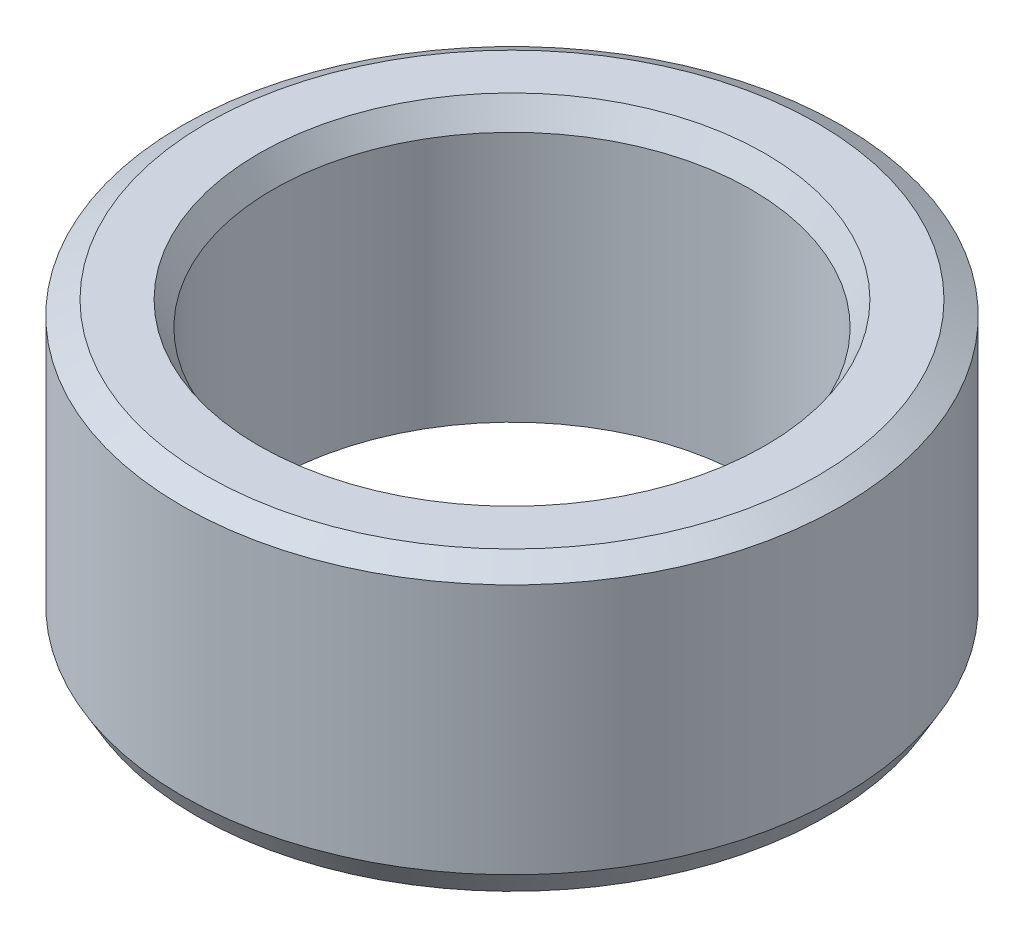
ISO-10303-21;
HEADER;
FILE_DESCRIPTION(('STEP AP214'),'2;1');
FILE_NAME('part.step','',(''),(''),'','','');
FILE_SCHEMA(('AUTOMOTIVE_DESIGN { 1 0 10303 214 1 1 1 1 }'));
ENDSEC;
DATA;
#1=APPLICATION_CONTEXT('core data for automotive mechanical design processes');
#2=APPLICATION_PROTOCOL_DEFINITION('international standard','automotive_design',2000,#1);
#3=PRODUCT_CONTEXT('',#1,'mechanical');
#4=PRODUCT('Part','Part','',(#3));
#5=PRODUCT_RELATED_PRODUCT_CATEGORY('part','',(#4));
#6=PRODUCT_DEFINITION_FORMATION('','',#4);
#7=PRODUCT_DEFINITION_CONTEXT('part definition',#1,'design');
#8=PRODUCT_DEFINITION('design','',#6,#7);
#9=PRODUCT_DEFINITION_SHAPE('','',#8);
#10=(LENGTH_UNIT() NAMED_UNIT(*) SI_UNIT(.MILLI.,.METRE.));
#11=(NAMED_UNIT(*) PLANE_ANGLE_UNIT() SI_UNIT($,.RADIAN.));
#12=(NAMED_UNIT(*) SI_UNIT($,.STERADIAN.) SOLID_ANGLE_UNIT());
#13=UNCERTAINTY_MEASURE_WITH_UNIT(LENGTH_MEASURE(1.E-05),#10,'distance_accuracy_value','');
#14=(GEOMETRIC_REPRESENTATION_CONTEXT(3) GLOBAL_UNCERTAINTY_ASSIGNED_CONTEXT((#13)) GLOBAL_UNIT_ASSIGNED_CONTEXT((#10,
#11,#12)) REPRESENTATION_CONTEXT('',''));
#15=CARTESIAN_POINT('',(0.,0.,0.));
#16=DIRECTION('',(0.,0.,1.));
#17=DIRECTION('',(1.,0.,0.));
#18=AXIS2_PLACEMENT_3D('',#15,#16,#17);
#19=CARTESIAN_POINT('',(0.,10.9655938453423,0.));
#20=DIRECTION('',(0.,-1.,0.));
#21=DIRECTION('',(0.,0.,-1.));
#22=AXIS2_PLACEMENT_3D('',#19,#20,#21);
#23=CYLINDRICAL_SURFACE('',#22,12.5);
#24=CARTESIAN_POINT('',(0.,0.917911089490356,0.));
#25=DIRECTION('',(0.,1.,0.));
#26=DIRECTION('',(0.,0.,1.));
#27=AXIS2_PLACEMENT_3D('',#24,#25,#26);
#28=CIRCLE('',#27,12.5);
#29=CARTESIAN_POINT('',(0.,0.917911089490356,-12.5));
#30=VERTEX_POINT('',#29);
#31=EDGE_CURVE('E10',#30,#30,#28,.T.);
#32=CARTESIAN_POINT('',(0.,10.435637630733,0.));
#33=DIRECTION('',(0.,1.,0.));
#34=DIRECTION('',(0.,0.,1.));
#35=AXIS2_PLACEMENT_3D('',#32,#33,#34);
#36=CIRCLE('',#35,12.5);
#37=CARTESIAN_POINT('',(0.,10.435637630733,-12.5));
#38=VERTEX_POINT('',#37);
#39=EDGE_CURVE('E50',#38,#38,#36,.F.);
#40=CARTESIAN_POINT('',(0.,0.917911089490356,-12.5));
#41=CARTESIAN_POINT('',(0.,1.01705407429497,-12.5));
#42=CARTESIAN_POINT('',(0.,1.11619705909958,-12.5));
#43=CARTESIAN_POINT('',(0.,1.3144830287088,-12.5));
#44=CARTESIAN_POINT('',(0.,1.41362601351341,-12.5));
#45=CARTESIAN_POINT('',(0.,1.61191198312263,-12.5));
#46=CARTESIAN_POINT('',(0.,1.71105496792724,-12.5));
#47=CARTESIAN_POINT('',(0.,1.90934093753646,-12.5));
#48=CARTESIAN_POINT('',(0.,2.00848392234107,-12.5));
#49=CARTESIAN_POINT('',(0.,2.20676989195029,-12.5));
#50=CARTESIAN_POINT('',(0.,2.3059128767549,-12.5));
#51=CARTESIAN_POINT('',(0.,2.50419884636413,-12.5));
#52=CARTESIAN_POINT('',(0.,2.60334183116874,-12.5));
#53=CARTESIAN_POINT('',(0.,2.80162780077796,-12.5));
#54=CARTESIAN_POINT('',(0.,2.90077078558257,-12.5));
#55=CARTESIAN_POINT('',(0.,3.09905675519179,-12.5));
#56=CARTESIAN_POINT('',(0.,3.1981997399964,-12.5));
#57=CARTESIAN_POINT('',(0.,3.39648570960562,-12.5));
#58=CARTESIAN_POINT('',(0.,3.49562869441023,-12.5));
#59=CARTESIAN_POINT('',(0.,3.69391466401945,-12.5));
#60=CARTESIAN_POINT('',(0.,3.79305764882406,-12.5));
#61=CARTESIAN_POINT('',(0.,3.99134361843328,-12.5));
#62=CARTESIAN_POINT('',(0.,4.09048660323789,-12.5));
#63=CARTESIAN_POINT('',(0.,4.28877257284712,-12.5));
#64=CARTESIAN_POINT('',(0.,4.38791555765173,-12.5));
#65=CARTESIAN_POINT('',(0.,4.58620152726095,-12.5));
#66=CARTESIAN_POINT('',(0.,4.68534451206556,-12.5));
#67=CARTESIAN_POINT('',(0.,4.88363048167478,-12.5));
#68=CARTESIAN_POINT('',(0.,4.98277346647939,-12.5));
#69=CARTESIAN_POINT('',(0.,5.18105943608861,-12.5));
#70=CARTESIAN_POINT('',(0.,5.28020242089322,-12.5));
#71=CARTESIAN_POINT('',(0.,5.47848839050244,-12.5));
#72=CARTESIAN_POINT('',(0.,5.57763137530705,-12.5));
#73=CARTESIAN_POINT('',(0.,5.77591734491627,-12.5));
#74=CARTESIAN_POINT('',(0.,5.87506032972089,-12.5));
#75=CARTESIAN_POINT('',(0.,6.07334629933011,-12.5));
#76=CARTESIAN_POINT('',(0.,6.17248928413472,-12.5));
#77=CARTESIAN_POINT('',(0.,6.37077525374394,-12.5));
#78=CARTESIAN_POINT('',(0.,6.46991823854855,-12.5));
#79=CARTESIAN_POINT('',(0.,6.66820420815777,-12.5));
#80=CARTESIAN_POINT('',(0.,6.76734719296238,-12.5));
#81=CARTESIAN_POINT('',(0.,6.9656331625716,-12.5));
#82=CARTESIAN_POINT('',(0.,7.06477614737621,-12.5));
#83=CARTESIAN_POINT('',(0.,7.26306211698543,-12.5));
#84=CARTESIAN_POINT('',(0.,7.36220510179004,-12.5));
#85=CARTESIAN_POINT('',(0.,7.56049107139927,-12.5));
#86=CARTESIAN_POINT('',(0.,7.65963405620388,-12.5));
#87=CARTESIAN_POINT('',(0.,7.8579200258131,-12.5));
#88=CARTESIAN_POINT('',(0.,7.95706301061771,-12.5));
#89=CARTESIAN_POINT('',(0.,8.15534898022693,-12.5));
#90=CARTESIAN_POINT('',(0.,8.25449196503154,-12.5));
#91=CARTESIAN_POINT('',(0.,8.45277793464076,-12.5));
#92=CARTESIAN_POINT('',(0.,8.55192091944537,-12.5));
#93=CARTESIAN_POINT('',(0.,8.75020688905459,-12.5));
#94=CARTESIAN_POINT('',(0.,8.8493498738592,-12.5));
#95=CARTESIAN_POINT('',(0.,9.04763584346842,-12.5));
#96=CARTESIAN_POINT('',(0.,9.14677882827304,-12.5));
#97=CARTESIAN_POINT('',(0.,9.34506479788226,-12.5));
#98=CARTESIAN_POINT('',(0.,9.44420778268687,-12.5));
#99=CARTESIAN_POINT('',(0.,9.64249375229609,-12.5));
#100=CARTESIAN_POINT('',(0.,9.7416367371007,-12.5));
#101=CARTESIAN_POINT('',(0.,9.93992270670992,-12.5));
#102=CARTESIAN_POINT('',(0.,10.0390656915145,-12.5));
#103=CARTESIAN_POINT('',(0.,10.2373516611238,-12.5));
#104=CARTESIAN_POINT('',(0.,10.3364946459284,-12.5));
#105=CARTESIAN_POINT('',(0.,10.435637630733,-12.5));
#106=B_SPLINE_CURVE_WITH_KNOTS('',3,(#40,#41,#42,#43,#44,#45,#46,#47,#48,#49,#50,#51,#52,#53,
#54,#55,#56,#57,#58,#59,#60,#61,#62,#63,#64,#65,#66,#67,#68,#69,#70,#71,#72,#73,#74,#75,#76,#77,
#78,#79,#80,#81,#82,#83,#84,#85,#86,#87,#88,#89,#90,#91,#92,#93,#94,#95,#96,#97,#98,#99,#100,
#101,#102,#103,#104,#105),.UNSPECIFIED.,.F.,.F.,(4,2,2,2,2,2,2,2,2,2,2,2,2,2,2,2,2,2,2,2,2,2,2,
2,2,2,2,2,2,2,2,2,4),(0.,0.297428954413832,0.594857908827663,0.892286863241495,1.18971581765533,
1.48714477206916,1.78457372648299,2.08200268089682,2.37943163531065,2.67686058972449,
2.97428954413832,3.27171849855215,3.56914745296598,3.86657640737981,4.16400536179364,
4.46143431620748,4.75886327062131,5.05629222503514,5.35372117944897,5.6511501338628,
5.94857908827664,6.24600804269047,6.5434369971043,6.84086595151813,7.13829490593196,
7.43572386034579,7.73315281475962,8.03058176917346,8.32801072358729,8.62543967800112,
8.92286863241495,9.22029758682878,9.51772654124261),.UNSPECIFIED.);
#107=EDGE_CURVE('BSEAM39',#30,#38,#106,.T.);
#108=ORIENTED_EDGE('',*,*,#31,.T.);
#109=ORIENTED_EDGE('',*,*,#39,.T.);
#110=ORIENTED_EDGE('',*,*,#107,.T.);
#111=ORIENTED_EDGE('',*,*,#107,.F.);
#112=EDGE_LOOP('',(#108,#110,#109,#111));
#113=FACE_BOUND('',#112,.T.);
#114=ADVANCED_FACE('F39',(#113),#23,.T.);
#115=CARTESIAN_POINT('',(0.,10.9655938453423,0.));
#116=DIRECTION('',(0.,1.,0.));
#117=DIRECTION('',(0.,0.,1.));
#118=AXIS2_PLACEMENT_3D('',#115,#116,#117);
#119=PLANE('',#118);
#120=CARTESIAN_POINT('',(0.,10.9655938453423,0.));
#121=DIRECTION('',(0.,1.,0.));
#122=DIRECTION('',(0.,0.,1.));
#123=AXIS2_PLACEMENT_3D('',#120,#121,#122);
#124=CIRCLE('',#123,9.59589626051556);
#125=CARTESIAN_POINT('',(0.,10.9655938453423,9.59589626051556));
#126=VERTEX_POINT('',#125);
#127=EDGE_CURVE('E58',#126,#126,#124,.F.);
#128=ORIENTED_EDGE('',*,*,#127,.T.);
#129=EDGE_LOOP('',(#128));
#130=FACE_BOUND('',#129,.T.);
#131=CARTESIAN_POINT('',(0.,10.9655938453423,0.));
#132=DIRECTION('',(0.,1.,0.));
#133=DIRECTION('',(0.,0.,1.));
#134=AXIS2_PLACEMENT_3D('',#131,#132,#133);
#135=CIRCLE('',#134,11.5820889105097);
#136=CARTESIAN_POINT('',(0.,10.9655938453423,11.5820889105097));
#137=VERTEX_POINT('',#136);
#138=EDGE_CURVE('E61',#137,#137,#135,.T.);
#139=ORIENTED_EDGE('',*,*,#138,.T.);
#140=EDGE_LOOP('',(#139));
#141=FACE_BOUND('',#140,.T.);
#142=ADVANCED_FACE('F88',(#130,#141),#119,.T.);
#143=CARTESIAN_POINT('',(0.,0.,0.));
#144=DIRECTION('',(0.,1.,0.));
#145=DIRECTION('',(0.,0.,1.));
#146=AXIS2_PLACEMENT_3D('',#143,#144,#145);
#147=PLANE('',#146);
#148=CARTESIAN_POINT('',(0.,0.,0.));
#149=DIRECTION('',(0.,1.,0.));
#150=DIRECTION('',(0.,0.,1.));
#151=AXIS2_PLACEMENT_3D('',#148,#149,#150);
#152=CIRCLE('',#151,9.98385113539646);
#153=CARTESIAN_POINT('',(0.,0.,9.98385113539646));
#154=VERTEX_POINT('',#153);
#155=EDGE_CURVE('E51',#154,#154,#152,.T.);
#156=ORIENTED_EDGE('',*,*,#155,.T.);
#157=EDGE_LOOP('',(#156));
#158=FACE_BOUND('',#157,.T.);
#159=CARTESIAN_POINT('',(0.,0.,0.));
#160=DIRECTION('',(0.,1.,0.));
#161=DIRECTION('',(0.,0.,1.));
#162=AXIS2_PLACEMENT_3D('',#159,#160,#161);
#163=CIRCLE('',#162,11.9700437853906);
#164=CARTESIAN_POINT('',(0.,0.,11.9700437853906));
#165=VERTEX_POINT('',#164);
#166=EDGE_CURVE('E54',#165,#165,#163,.F.);
#167=ORIENTED_EDGE('',*,*,#166,.T.);
#168=EDGE_LOOP('',(#167));
#169=FACE_BOUND('',#168,.T.);
#170=ADVANCED_FACE('F83',(#158,#169),#147,.F.);
#171=CARTESIAN_POINT('',(0.,10.9655938453423,0.));
#172=DIRECTION('',(0.,-1.,0.));
#173=DIRECTION('',(0.,0.,-1.));
#174=AXIS2_PLACEMENT_3D('',#171,#172,#173);
#175=CYLINDRICAL_SURFACE('',#174,9.06594004590615);
#176=CARTESIAN_POINT('',(0.,10.047682755852,0.));
#177=DIRECTION('',(0.,1.,0.));
#178=DIRECTION('',(0.,0.,1.));
#179=AXIS2_PLACEMENT_3D('',#176,#177,#178);
#180=CIRCLE('',#179,9.06594004590615);
#181=CARTESIAN_POINT('',(0.,10.047682755852,-9.06594004590615));
#182=VERTEX_POINT('',#181);
#183=EDGE_CURVE('E67',#182,#182,#180,.T.);
#184=CARTESIAN_POINT('',(0.,0.529956214609375,0.));
#185=DIRECTION('',(0.,1.,0.));
#186=DIRECTION('',(0.,0.,1.));
#187=AXIS2_PLACEMENT_3D('',#184,#185,#186);
#188=CIRCLE('',#187,9.06594004590615);
#189=CARTESIAN_POINT('',(0.,0.529956214609373,-9.06594004590615));
#190=VERTEX_POINT('',#189);
#191=EDGE_CURVE('E69',#190,#190,#188,.F.);
#192=CARTESIAN_POINT('',(0.,10.047682755852,-9.06594004590615));
#193=CARTESIAN_POINT('',(0.,9.94853977104735,-9.06594004590615));
#194=CARTESIAN_POINT('',(0.,9.84939678624274,-9.06594004590615));
#195=CARTESIAN_POINT('',(0.,9.65111081663352,-9.06594004590615));
#196=CARTESIAN_POINT('',(0.,9.55196783182891,-9.06594004590615));
#197=CARTESIAN_POINT('',(0.,9.35368186221969,-9.06594004590615));
#198=CARTESIAN_POINT('',(0.,9.25453887741508,-9.06594004590615));
#199=CARTESIAN_POINT('',(0.,9.05625290780586,-9.06594004590615));
#200=CARTESIAN_POINT('',(0.,8.95710992300125,-9.06594004590615));
#201=CARTESIAN_POINT('',(0.,8.75882395339203,-9.06594004590615));
#202=CARTESIAN_POINT('',(0.,8.65968096858742,-9.06594004590615));
#203=CARTESIAN_POINT('',(0.,8.4613949989782,-9.06594004590615));
#204=CARTESIAN_POINT('',(0.,8.36225201417359,-9.06594004590615));
#205=CARTESIAN_POINT('',(0.,8.16396604456437,-9.06594004590615));
#206=CARTESIAN_POINT('',(0.,8.06482305975976,-9.06594004590615));
#207=CARTESIAN_POINT('',(0.,7.86653709015054,-9.06594004590615));
#208=CARTESIAN_POINT('',(0.,7.76739410534593,-9.06594004590615));
#209=CARTESIAN_POINT('',(0.,7.56910813573671,-9.06594004590615));
#210=CARTESIAN_POINT('',(0.,7.4699651509321,-9.06594004590615));
#211=CARTESIAN_POINT('',(0.,7.27167918132287,-9.06594004590615));
#212=CARTESIAN_POINT('',(0.,7.17253619651826,-9.06594004590615));
#213=CARTESIAN_POINT('',(0.,6.97425022690904,-9.06594004590615));
#214=CARTESIAN_POINT('',(0.,6.87510724210443,-9.06594004590615));
#215=CARTESIAN_POINT('',(0.,6.67682127249521,-9.06594004590615));
#216=CARTESIAN_POINT('',(0.,6.5776782876906,-9.06594004590615));
#217=CARTESIAN_POINT('',(0.,6.37939231808138,-9.06594004590615));
#218=CARTESIAN_POINT('',(0.,6.28024933327677,-9.06594004590615));
#219=CARTESIAN_POINT('',(0.,6.08196336366755,-9.06594004590615));
#220=CARTESIAN_POINT('',(0.,5.98282037886294,-9.06594004590615));
#221=CARTESIAN_POINT('',(0.,5.78453440925372,-9.06594004590615));
#222=CARTESIAN_POINT('',(0.,5.68539142444911,-9.06594004590615));
#223=CARTESIAN_POINT('',(0.,5.48710545483989,-9.06594004590615));
#224=CARTESIAN_POINT('',(0.,5.38796247003528,-9.06594004590615));
#225=CARTESIAN_POINT('',(0.,5.18967650042606,-9.06594004590615));
#226=CARTESIAN_POINT('',(0.,5.09053351562145,-9.06594004590615));
#227=CARTESIAN_POINT('',(0.,4.89224754601223,-9.06594004590615));
#228=CARTESIAN_POINT('',(0.,4.79310456120762,-9.06594004590615));
#229=CARTESIAN_POINT('',(0.,4.5948185915984,-9.06594004590615));
#230=CARTESIAN_POINT('',(0.,4.49567560679379,-9.06594004590615));
#231=CARTESIAN_POINT('',(0.,4.29738963718457,-9.06594004590615));
#232=CARTESIAN_POINT('',(0.,4.19824665237995,-9.06594004590615));
#233=CARTESIAN_POINT('',(0.,3.99996068277073,-9.06594004590615));
#234=CARTESIAN_POINT('',(0.,3.90081769796612,-9.06594004590615));
#235=CARTESIAN_POINT('',(0.,3.7025317283569,-9.06594004590615));
#236=CARTESIAN_POINT('',(0.,3.60338874355229,-9.06594004590615));
#237=CARTESIAN_POINT('',(0.,3.40510277394307,-9.06594004590615));
#238=CARTESIAN_POINT('',(0.,3.30595978913846,-9.06594004590615));
#239=CARTESIAN_POINT('',(0.,3.10767381952924,-9.06594004590615));
#240=CARTESIAN_POINT('',(0.,3.00853083472463,-9.06594004590615));
#241=CARTESIAN_POINT('',(0.,2.81024486511541,-9.06594004590615));
#242=CARTESIAN_POINT('',(0.,2.7111018803108,-9.06594004590615));
#243=CARTESIAN_POINT('',(0.,2.51281591070158,-9.06594004590615));
#244=CARTESIAN_POINT('',(0.,2.41367292589697,-9.06594004590615));
#245=CARTESIAN_POINT('',(0.,2.21538695628775,-9.06594004590615));
#246=CARTESIAN_POINT('',(0.,2.11624397148314,-9.06594004590615));
#247=CARTESIAN_POINT('',(0.,1.91795800187392,-9.06594004590615));
#248=CARTESIAN_POINT('',(0.,1.81881501706931,-9.06594004590615));
#249=CARTESIAN_POINT('',(0.,1.62052904746009,-9.06594004590615));
#250=CARTESIAN_POINT('',(0.,1.52138606265548,-9.06594004590615));
#251=CARTESIAN_POINT('',(0.,1.32310009304625,-9.06594004590615));
#252=CARTESIAN_POINT('',(0.,1.22395710824164,-9.06594004590615));
#253=CARTESIAN_POINT('',(0.,1.02567113863242,-9.06594004590615));
#254=CARTESIAN_POINT('',(0.,0.926528153827815,-9.06594004590615));
#255=CARTESIAN_POINT('',(0.,0.728242184218595,-9.06594004590615));
#256=CARTESIAN_POINT('',(0.,0.629099199413984,-9.06594004590615));
#257=CARTESIAN_POINT('',(0.,0.529956214609373,-9.06594004590615));
#258=B_SPLINE_CURVE_WITH_KNOTS('',3,(#192,#193,#194,#195,#196,#197,#198,#199,#200,#201,#202,
#203,#204,#205,#206,#207,#208,#209,#210,#211,#212,#213,#214,#215,#216,#217,#218,#219,#220,#221,
#222,#223,#224,#225,#226,#227,#228,#229,#230,#231,#232,#233,#234,#235,#236,#237,#238,#239,#240,
#241,#242,#243,#244,#245,#246,#247,#248,#249,#250,#251,#252,#253,#254,#255,#256,#257),
.UNSPECIFIED.,.F.,.F.,(4,2,2,2,2,2,2,2,2,2,2,2,2,2,2,2,2,2,2,2,2,2,2,2,2,2,2,2,2,2,2,2,4),(0.,
0.297428954413832,0.594857908827663,0.892286863241493,1.18971581765532,1.48714477206916,
1.78457372648299,2.08200268089682,2.37943163531065,2.67686058972448,2.97428954413831,
3.27171849855214,3.56914745296597,3.8665764073798,4.16400536179363,4.46143431620747,
4.7588632706213,5.05629222503513,5.35372117944896,5.65115013386279,5.94857908827662,
6.24600804269045,6.54343699710428,6.84086595151811,7.13829490593194,7.43572386034577,
7.73315281475961,8.03058176917344,8.32801072358727,8.6254396780011,8.92286863241493,
9.22029758682876,9.51772654124259),.UNSPECIFIED.);
#259=EDGE_CURVE('BSEAM71',#182,#190,#258,.T.);
#260=ORIENTED_EDGE('',*,*,#183,.T.);
#261=ORIENTED_EDGE('',*,*,#191,.T.);
#262=ORIENTED_EDGE('',*,*,#259,.T.);
#263=ORIENTED_EDGE('',*,*,#259,.F.);
#264=EDGE_LOOP('',(#260,#262,#261,#263));
#265=FACE_BOUND('',#264,.T.);
#266=ADVANCED_FACE('F71',(#265),#175,.F.);
#267=CARTESIAN_POINT('',(0.,10.047682755852,0.));
#268=DIRECTION('',(0.,1.,0.));
#269=DIRECTION('',(0.,0.,1.));
#270=AXIS2_PLACEMENT_3D('',#267,#268,#269);
#271=CONICAL_SURFACE('',#270,9.06594004590615,0.523598775598303);
#272=ORIENTED_EDGE('',*,*,#127,.F.);
#273=EDGE_LOOP('',(#272));
#274=FACE_BOUND('',#273,.T.);
#275=ORIENTED_EDGE('',*,*,#183,.F.);
#276=EDGE_LOOP('',(#275));
#277=FACE_BOUND('',#276,.T.);
#278=ADVANCED_FACE('F77',(#274,#277),#271,.F.);
#279=CARTESIAN_POINT('',(0.,0.,0.));
#280=DIRECTION('',(0.,-1.,0.));
#281=DIRECTION('',(0.,0.,-1.));
#282=AXIS2_PLACEMENT_3D('',#279,#280,#281);
#283=CONICAL_SURFACE('',#282,9.98385113539646,1.0471975511966);
#284=ORIENTED_EDGE('',*,*,#191,.F.);
#285=EDGE_LOOP('',(#284));
#286=FACE_BOUND('',#285,.T.);
#287=ORIENTED_EDGE('',*,*,#155,.F.);
#288=EDGE_LOOP('',(#287));
#289=FACE_BOUND('',#288,.T.);
#290=ADVANCED_FACE('F73',(#286,#289),#283,.F.);
#291=CARTESIAN_POINT('',(0.,0.917911089490356,0.));
#292=DIRECTION('',(0.,1.,0.));
#293=DIRECTION('',(0.,0.,1.));
#294=AXIS2_PLACEMENT_3D('',#291,#292,#293);
#295=CONICAL_SURFACE('',#294,12.5,0.523598775598303);
#296=ORIENTED_EDGE('',*,*,#166,.F.);
#297=EDGE_LOOP('',(#296));
#298=FACE_BOUND('',#297,.T.);
#299=ORIENTED_EDGE('',*,*,#31,.F.);
#300=EDGE_LOOP('',(#299));
#301=FACE_BOUND('',#300,.T.);
#302=ADVANCED_FACE('F76',(#298,#301),#295,.T.);
#303=CARTESIAN_POINT('',(0.,10.9655938453423,0.));
#304=DIRECTION('',(0.,-1.,0.));
#305=DIRECTION('',(0.,0.,-1.));
#306=AXIS2_PLACEMENT_3D('',#303,#304,#305);
#307=CONICAL_SURFACE('',#306,11.5820889105097,1.04719755119659);
#308=ORIENTED_EDGE('',*,*,#39,.F.);
#309=EDGE_LOOP('',(#308));
#310=FACE_BOUND('',#309,.T.);
#311=ORIENTED_EDGE('',*,*,#138,.F.);
#312=EDGE_LOOP('',(#311));
#313=FACE_BOUND('',#312,.T.);
#314=ADVANCED_FACE('F45',(#310,#313),#307,.T.);
#315=CLOSED_SHELL('',(#114,#142,#170,#266,#278,#290,#302,#314));
#316=MANIFOLD_SOLID_BREP('B2',#315);
#317=ADVANCED_BREP_SHAPE_REPRESENTATION('',(#18,#316),#14);
#318=SHAPE_DEFINITION_REPRESENTATION(#9,#317);
ENDSEC;
END-ISO-10303-21;
